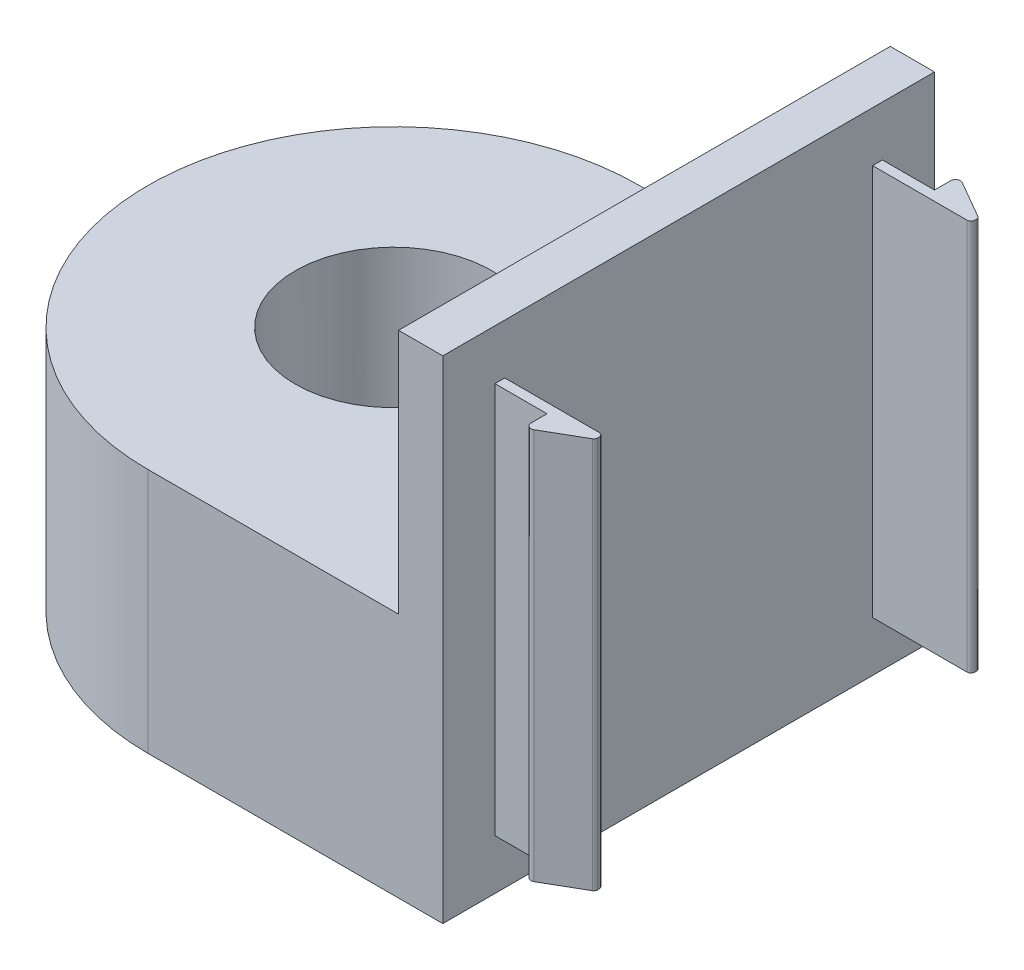
ISO-10303-21;
HEADER;
FILE_DESCRIPTION(('STEP AP214'),'2;1');
FILE_NAME('part.step','',(''),(''),'','','');
FILE_SCHEMA(('AUTOMOTIVE_DESIGN { 1 0 10303 214 1 1 1 1 }'));
ENDSEC;
DATA;
#1=APPLICATION_CONTEXT('core data for automotive mechanical design processes');
#2=APPLICATION_PROTOCOL_DEFINITION('international standard','automotive_design',2000,#1);
#3=PRODUCT_CONTEXT('',#1,'mechanical');
#4=PRODUCT('Part','Part','',(#3));
#5=PRODUCT_RELATED_PRODUCT_CATEGORY('part','',(#4));
#6=PRODUCT_DEFINITION_FORMATION('','',#4);
#7=PRODUCT_DEFINITION_CONTEXT('part definition',#1,'design');
#8=PRODUCT_DEFINITION('design','',#6,#7);
#9=PRODUCT_DEFINITION_SHAPE('','',#8);
#10=(LENGTH_UNIT() NAMED_UNIT(*) SI_UNIT(.MILLI.,.METRE.));
#11=(NAMED_UNIT(*) PLANE_ANGLE_UNIT() SI_UNIT($,.RADIAN.));
#12=(NAMED_UNIT(*) SI_UNIT($,.STERADIAN.) SOLID_ANGLE_UNIT());
#13=UNCERTAINTY_MEASURE_WITH_UNIT(LENGTH_MEASURE(1.E-05),#10,'distance_accuracy_value','');
#14=(GEOMETRIC_REPRESENTATION_CONTEXT(3) GLOBAL_UNCERTAINTY_ASSIGNED_CONTEXT((#13)) GLOBAL_UNIT_ASSIGNED_CONTEXT((#10,
#11,#12)) REPRESENTATION_CONTEXT('',''));
#15=CARTESIAN_POINT('',(0.,0.,0.));
#16=DIRECTION('',(0.,0.,1.));
#17=DIRECTION('',(1.,0.,0.));
#18=AXIS2_PLACEMENT_3D('',#15,#16,#17);
#19=CARTESIAN_POINT('',(-25.,50.,-25.));
#20=DIRECTION('',(0.,1.,0.));
#21=DIRECTION('',(0.,0.,1.));
#22=AXIS2_PLACEMENT_3D('',#19,#20,#21);
#23=PLANE('',#22);
#24=DIRECTION('',(0.,0.,-1.));
#25=VECTOR('',#24,1.);
#26=CARTESIAN_POINT('',(5.,50.,0.));
#27=LINE('',#26,#25);
#28=CARTESIAN_POINT('',(5.,50.,0.));
#29=VERTEX_POINT('',#28);
#30=CARTESIAN_POINT('',(4.99999999999999,50.,-50.));
#31=VERTEX_POINT('',#30);
#32=EDGE_CURVE('E349',#29,#31,#27,.T.);
#33=ORIENTED_EDGE('',*,*,#32,.T.);
#34=DIRECTION('',(-1.,0.,0.));
#35=VECTOR('',#34,1.);
#36=CARTESIAN_POINT('',(0.,50.,-50.));
#37=LINE('',#36,#35);
#38=CARTESIAN_POINT('',(0.5,50.,-50.));
#39=VERTEX_POINT('',#38);
#40=EDGE_CURVE('E352',#31,#39,#37,.T.);
#41=ORIENTED_EDGE('',*,*,#40,.T.);
#42=DIRECTION('',(0.,0.,1.));
#43=VECTOR('',#42,1.);
#44=CARTESIAN_POINT('',(0.500000000000004,50.,0.));
#45=LINE('',#44,#43);
#46=CARTESIAN_POINT('',(0.500000000000004,50.,0.));
#47=VERTEX_POINT('',#46);
#48=EDGE_CURVE('E329',#39,#47,#45,.T.);
#49=ORIENTED_EDGE('',*,*,#48,.T.);
#50=DIRECTION('',(1.,0.,0.));
#51=VECTOR('',#50,1.);
#52=CARTESIAN_POINT('',(0.,50.,0.));
#53=LINE('',#52,#51);
#54=EDGE_CURVE('E347',#47,#29,#53,.T.);
#55=ORIENTED_EDGE('',*,*,#54,.T.);
#56=EDGE_LOOP('',(#33,#41,#49,#55));
#57=FACE_BOUND('',#56,.T.);
#58=ADVANCED_FACE('F41',(#57),#23,.T.);
#59=CARTESIAN_POINT('',(10.3,50.,-5.3));
#60=DIRECTION('',(0.,0.,-1.));
#61=DIRECTION('',(-1.,0.,0.));
#62=AXIS2_PLACEMENT_3D('',#59,#60,#61);
#63=PLANE('',#62);
#64=DIRECTION('',(1.,0.,0.));
#65=VECTOR('',#64,1.);
#66=CARTESIAN_POINT('',(10.3,44.9,-5.3));
#67=LINE('',#66,#65);
#68=CARTESIAN_POINT('',(5.,44.9,-5.3));
#69=VERTEX_POINT('',#68);
#70=CARTESIAN_POINT('',(10.3,44.9,-5.3));
#71=VERTEX_POINT('',#70);
#72=EDGE_CURVE('E226',#69,#71,#67,.T.);
#73=ORIENTED_EDGE('',*,*,#72,.F.);
#74=DIRECTION('',(0.,-1.,0.));
#75=VECTOR('',#74,1.);
#76=CARTESIAN_POINT('',(5.,50.,-5.3));
#77=LINE('',#76,#75);
#78=CARTESIAN_POINT('',(5.,5.1,-5.3));
#79=VERTEX_POINT('',#78);
#80=EDGE_CURVE('E218',#69,#79,#77,.T.);
#81=ORIENTED_EDGE('',*,*,#80,.T.);
#82=DIRECTION('',(1.,0.,0.));
#83=VECTOR('',#82,1.);
#84=CARTESIAN_POINT('',(10.3,5.1,-5.3));
#85=LINE('',#84,#83);
#86=CARTESIAN_POINT('',(10.3,5.1,-5.3));
#87=VERTEX_POINT('',#86);
#88=EDGE_CURVE('E200',#79,#87,#85,.T.);
#89=ORIENTED_EDGE('',*,*,#88,.T.);
#90=DIRECTION('',(0.,-1.,0.));
#91=VECTOR('',#90,1.);
#92=CARTESIAN_POINT('',(10.3,50.,-5.3));
#93=LINE('',#92,#91);
#94=EDGE_CURVE('E228',#71,#87,#93,.T.);
#95=ORIENTED_EDGE('',*,*,#94,.F.);
#96=EDGE_LOOP('',(#73,#81,#89,#95));
#97=FACE_BOUND('',#96,.T.);
#98=ADVANCED_FACE('F225',(#97),#63,.F.);
#99=CARTESIAN_POINT('',(10.3,50.,-2.8));
#100=DIRECTION('',(1.,0.,0.));
#101=DIRECTION('',(0.,0.,-1.));
#102=AXIS2_PLACEMENT_3D('',#99,#100,#101);
#103=PLANE('',#102);
#104=DIRECTION('',(0.,0.,1.));
#105=VECTOR('',#104,1.);
#106=CARTESIAN_POINT('',(10.3,5.1,-2.8));
#107=LINE('',#106,#105);
#108=CARTESIAN_POINT('',(10.3,5.1,-3.66602540378444));
#109=VERTEX_POINT('',#108);
#110=EDGE_CURVE('E206',#87,#109,#107,.T.);
#111=ORIENTED_EDGE('',*,*,#110,.T.);
#112=DIRECTION('',(0.,-1.,0.));
#113=VECTOR('',#112,1.);
#114=CARTESIAN_POINT('',(10.3,50.,-3.66602540378444));
#115=LINE('',#114,#113);
#116=CARTESIAN_POINT('',(10.3,44.9,-3.66602540378444));
#117=VERTEX_POINT('',#116);
#118=EDGE_CURVE('E49',#109,#117,#115,.F.);
#119=ORIENTED_EDGE('',*,*,#118,.T.);
#120=DIRECTION('',(0.,0.,1.));
#121=VECTOR('',#120,1.);
#122=CARTESIAN_POINT('',(10.3,44.9,-2.8));
#123=LINE('',#122,#121);
#124=EDGE_CURVE('E319',#71,#117,#123,.T.);
#125=ORIENTED_EDGE('',*,*,#124,.F.);
#126=ORIENTED_EDGE('',*,*,#94,.T.);
#127=EDGE_LOOP('',(#111,#119,#125,#126));
#128=FACE_BOUND('',#127,.T.);
#129=ADVANCED_FACE('F463',(#128),#103,.F.);
#130=CARTESIAN_POINT('',(15.,50.,-5.51354626519127));
#131=DIRECTION('',(-0.500000000000004,0.,-0.866025403784436));
#132=DIRECTION('',(-0.866025403784436,0.,0.500000000000004));
#133=AXIS2_PLACEMENT_3D('',#130,#131,#132);
#134=PLANE('',#133);
#135=DIRECTION('',(0.866025403784436,0.,-0.500000000000004));
#136=VECTOR('',#135,1.);
#137=CARTESIAN_POINT('',(15.,44.9,-5.51354626519127));
#138=LINE('',#137,#136);
#139=CARTESIAN_POINT('',(11.05,44.9,-3.23301270189223));
#140=VERTEX_POINT('',#139);
#141=CARTESIAN_POINT('',(14.8,44.9,-5.39807621135335));
#142=VERTEX_POINT('',#141);
#143=EDGE_CURVE('E294',#140,#142,#138,.T.);
#144=ORIENTED_EDGE('',*,*,#143,.F.);
#145=DIRECTION('',(0.,-1.,0.));
#146=VECTOR('',#145,1.);
#147=CARTESIAN_POINT('',(11.05,50.,-3.23301270189223));
#148=LINE('',#147,#146);
#149=CARTESIAN_POINT('',(11.05,5.1,-3.23301270189223));
#150=VERTEX_POINT('',#149);
#151=EDGE_CURVE('E286',#140,#150,#148,.T.);
#152=ORIENTED_EDGE('',*,*,#151,.T.);
#153=DIRECTION('',(0.866025403784436,0.,-0.500000000000004));
#154=VECTOR('',#153,1.);
#155=CARTESIAN_POINT('',(15.,5.1,-5.51354626519127));
#156=LINE('',#155,#154);
#157=CARTESIAN_POINT('',(14.8,5.1,-5.39807621135335));
#158=VERTEX_POINT('',#157);
#159=EDGE_CURVE('E293',#150,#158,#156,.T.);
#160=ORIENTED_EDGE('',*,*,#159,.T.);
#161=DIRECTION('',(0.,-1.,0.));
#162=VECTOR('',#161,1.);
#163=CARTESIAN_POINT('',(14.8,50.,-5.39807621135335));
#164=LINE('',#163,#162);
#165=EDGE_CURVE('E274',#158,#142,#164,.F.);
#166=ORIENTED_EDGE('',*,*,#165,.T.);
#167=EDGE_LOOP('',(#144,#152,#160,#166));
#168=FACE_BOUND('',#167,.T.);
#169=ADVANCED_FACE('F292',(#168),#134,.F.);
#170=CARTESIAN_POINT('',(15.,50.,-6.3));
#171=DIRECTION('',(-1.,0.,0.));
#172=DIRECTION('',(0.,0.,1.));
#173=AXIS2_PLACEMENT_3D('',#170,#171,#172);
#174=PLANE('',#173);
#175=DIRECTION('',(0.,0.,-1.));
#176=VECTOR('',#175,1.);
#177=CARTESIAN_POINT('',(15.,5.1,0.));
#178=LINE('',#177,#176);
#179=CARTESIAN_POINT('',(15.,5.1,-5.74448637286712));
#180=VERTEX_POINT('',#179);
#181=CARTESIAN_POINT('',(15.,5.1,-5.9));
#182=VERTEX_POINT('',#181);
#183=EDGE_CURVE('E394',#180,#182,#178,.T.);
#184=ORIENTED_EDGE('',*,*,#183,.T.);
#185=DIRECTION('',(0.,-1.,0.));
#186=VECTOR('',#185,1.);
#187=CARTESIAN_POINT('',(15.,50.,-5.9));
#188=LINE('',#187,#186);
#189=CARTESIAN_POINT('',(15.,44.9,-5.9));
#190=VERTEX_POINT('',#189);
#191=EDGE_CURVE('E268',#182,#190,#188,.F.);
#192=ORIENTED_EDGE('',*,*,#191,.T.);
#193=DIRECTION('',(0.,0.,-1.));
#194=VECTOR('',#193,1.);
#195=CARTESIAN_POINT('',(15.,44.9,0.));
#196=LINE('',#195,#194);
#197=CARTESIAN_POINT('',(15.,44.9,-5.74448637286712));
#198=VERTEX_POINT('',#197);
#199=EDGE_CURVE('E399',#198,#190,#196,.T.);
#200=ORIENTED_EDGE('',*,*,#199,.F.);
#201=DIRECTION('',(0.,-1.,0.));
#202=VECTOR('',#201,1.);
#203=CARTESIAN_POINT('',(15.,50.,-5.74448637286712));
#204=LINE('',#203,#202);
#205=EDGE_CURVE('E265',#198,#180,#204,.T.);
#206=ORIENTED_EDGE('',*,*,#205,.T.);
#207=EDGE_LOOP('',(#184,#192,#200,#206));
#208=FACE_BOUND('',#207,.T.);
#209=ADVANCED_FACE('F498',(#208),#174,.F.);
#210=CARTESIAN_POINT('',(5.,50.,-6.3));
#211=DIRECTION('',(0.,0.,1.));
#212=DIRECTION('',(1.,0.,0.));
#213=AXIS2_PLACEMENT_3D('',#210,#211,#212);
#214=PLANE('',#213);
#215=DIRECTION('',(-1.,0.,0.));
#216=VECTOR('',#215,1.);
#217=CARTESIAN_POINT('',(5.,44.9,-6.3));
#218=LINE('',#217,#216);
#219=CARTESIAN_POINT('',(14.6,44.9,-6.3));
#220=VERTEX_POINT('',#219);
#221=CARTESIAN_POINT('',(5.,44.9,-6.3));
#222=VERTEX_POINT('',#221);
#223=EDGE_CURVE('E316',#220,#222,#218,.T.);
#224=ORIENTED_EDGE('',*,*,#223,.F.);
#225=DIRECTION('',(0.,-1.,0.));
#226=VECTOR('',#225,1.);
#227=CARTESIAN_POINT('',(14.6,50.,-6.3));
#228=LINE('',#227,#226);
#229=CARTESIAN_POINT('',(14.6,5.1,-6.3));
#230=VERTEX_POINT('',#229);
#231=EDGE_CURVE('E257',#220,#230,#228,.T.);
#232=ORIENTED_EDGE('',*,*,#231,.T.);
#233=DIRECTION('',(-1.,0.,0.));
#234=VECTOR('',#233,1.);
#235=CARTESIAN_POINT('',(5.,5.1,-6.3));
#236=LINE('',#235,#234);
#237=CARTESIAN_POINT('',(5.,5.1,-6.3));
#238=VERTEX_POINT('',#237);
#239=EDGE_CURVE('E299',#230,#238,#236,.T.);
#240=ORIENTED_EDGE('',*,*,#239,.T.);
#241=DIRECTION('',(0.,-1.,0.));
#242=VECTOR('',#241,1.);
#243=CARTESIAN_POINT('',(5.,50.,-6.3));
#244=LINE('',#243,#242);
#245=EDGE_CURVE('E220',#222,#238,#244,.T.);
#246=ORIENTED_EDGE('',*,*,#245,.F.);
#247=EDGE_LOOP('',(#224,#232,#240,#246));
#248=FACE_BOUND('',#247,.T.);
#249=ADVANCED_FACE('F495',(#248),#214,.F.);
#250=CARTESIAN_POINT('',(15.,50.,-43.7));
#251=DIRECTION('',(0.,0.,-1.));
#252=DIRECTION('',(-1.,0.,0.));
#253=AXIS2_PLACEMENT_3D('',#250,#251,#252);
#254=PLANE('',#253);
#255=DIRECTION('',(1.,0.,0.));
#256=VECTOR('',#255,1.);
#257=CARTESIAN_POINT('',(15.,5.1,-43.7));
#258=LINE('',#257,#256);
#259=CARTESIAN_POINT('',(4.99999999999999,5.1,-43.7));
#260=VERTEX_POINT('',#259);
#261=CARTESIAN_POINT('',(14.6,5.1,-43.7));
#262=VERTEX_POINT('',#261);
#263=EDGE_CURVE('E302',#260,#262,#258,.T.);
#264=ORIENTED_EDGE('',*,*,#263,.T.);
#265=DIRECTION('',(0.,-1.,0.));
#266=VECTOR('',#265,1.);
#267=CARTESIAN_POINT('',(14.6,50.,-43.7));
#268=LINE('',#267,#266);
#269=CARTESIAN_POINT('',(14.6,44.9,-43.7));
#270=VERTEX_POINT('',#269);
#271=EDGE_CURVE('E248',#262,#270,#268,.F.);
#272=ORIENTED_EDGE('',*,*,#271,.T.);
#273=DIRECTION('',(1.,0.,0.));
#274=VECTOR('',#273,1.);
#275=CARTESIAN_POINT('',(15.,44.9,-43.7));
#276=LINE('',#275,#274);
#277=CARTESIAN_POINT('',(4.99999999999999,44.9,-43.7));
#278=VERTEX_POINT('',#277);
#279=EDGE_CURVE('E313',#278,#270,#276,.T.);
#280=ORIENTED_EDGE('',*,*,#279,.F.);
#281=DIRECTION('',(0.,-1.,0.));
#282=VECTOR('',#281,1.);
#283=CARTESIAN_POINT('',(5.,50.,-43.7));
#284=LINE('',#283,#282);
#285=EDGE_CURVE('E377',#278,#260,#284,.T.);
#286=ORIENTED_EDGE('',*,*,#285,.T.);
#287=EDGE_LOOP('',(#264,#272,#280,#286));
#288=FACE_BOUND('',#287,.T.);
#289=ADVANCED_FACE('F383',(#288),#254,.F.);
#290=CARTESIAN_POINT('',(15.,50.,-44.4864537348087));
#291=DIRECTION('',(-1.,0.,0.));
#292=DIRECTION('',(0.,0.,1.));
#293=AXIS2_PLACEMENT_3D('',#290,#291,#292);
#294=PLANE('',#293);
#295=CARTESIAN_POINT('',(15.,44.9,-44.1));
#296=VERTEX_POINT('',#295);
#297=CARTESIAN_POINT('',(15.,44.9,-44.2555136271329));
#298=VERTEX_POINT('',#297);
#299=EDGE_CURVE('E425',#296,#298,#196,.T.);
#300=ORIENTED_EDGE('',*,*,#299,.F.);
#301=DIRECTION('',(0.,-1.,0.));
#302=VECTOR('',#301,1.);
#303=CARTESIAN_POINT('',(15.,50.,-44.1));
#304=LINE('',#303,#302);
#305=CARTESIAN_POINT('',(15.,5.1,-44.1));
#306=VERTEX_POINT('',#305);
#307=EDGE_CURVE('E241',#296,#306,#304,.T.);
#308=ORIENTED_EDGE('',*,*,#307,.T.);
#309=CARTESIAN_POINT('',(15.,5.1,-44.2555136271329));
#310=VERTEX_POINT('',#309);
#311=EDGE_CURVE('E221',#306,#310,#178,.T.);
#312=ORIENTED_EDGE('',*,*,#311,.T.);
#313=DIRECTION('',(0.,-1.,0.));
#314=VECTOR('',#313,1.);
#315=CARTESIAN_POINT('',(15.,50.,-44.2555136271329));
#316=LINE('',#315,#314);
#317=EDGE_CURVE('E230',#310,#298,#316,.F.);
#318=ORIENTED_EDGE('',*,*,#317,.T.);
#319=EDGE_LOOP('',(#300,#308,#312,#318));
#320=FACE_BOUND('',#319,.T.);
#321=ADVANCED_FACE('F443',(#320),#294,.F.);
#322=CARTESIAN_POINT('',(10.3,50.,-47.2));
#323=DIRECTION('',(-0.500000000000004,0.,0.866025403784436));
#324=DIRECTION('',(0.866025403784436,0.,0.500000000000004));
#325=AXIS2_PLACEMENT_3D('',#322,#323,#324);
#326=PLANE('',#325);
#327=DIRECTION('',(-0.866025403784436,0.,-0.500000000000004));
#328=VECTOR('',#327,1.);
#329=CARTESIAN_POINT('',(10.3,5.1,-47.2));
#330=LINE('',#329,#328);
#331=CARTESIAN_POINT('',(14.8,5.1,-44.6019237886467));
#332=VERTEX_POINT('',#331);
#333=CARTESIAN_POINT('',(11.05,5.1,-46.7669872981078));
#334=VERTEX_POINT('',#333);
#335=EDGE_CURVE('E401',#332,#334,#330,.T.);
#336=ORIENTED_EDGE('',*,*,#335,.T.);
#337=DIRECTION('',(0.,-1.,0.));
#338=VECTOR('',#337,1.);
#339=CARTESIAN_POINT('',(11.05,50.,-46.7669872981078));
#340=LINE('',#339,#338);
#341=CARTESIAN_POINT('',(11.05,44.9,-46.7669872981078));
#342=VERTEX_POINT('',#341);
#343=EDGE_CURVE('E282',#334,#342,#340,.F.);
#344=ORIENTED_EDGE('',*,*,#343,.T.);
#345=DIRECTION('',(-0.866025403784436,0.,-0.500000000000004));
#346=VECTOR('',#345,1.);
#347=CARTESIAN_POINT('',(10.3,44.9,-47.2));
#348=LINE('',#347,#346);
#349=CARTESIAN_POINT('',(14.8,44.9,-44.6019237886467));
#350=VERTEX_POINT('',#349);
#351=EDGE_CURVE('E310',#350,#342,#348,.T.);
#352=ORIENTED_EDGE('',*,*,#351,.F.);
#353=DIRECTION('',(0.,-1.,0.));
#354=VECTOR('',#353,1.);
#355=CARTESIAN_POINT('',(14.8,50.,-44.6019237886467));
#356=LINE('',#355,#354);
#357=EDGE_CURVE('E254',#350,#332,#356,.T.);
#358=ORIENTED_EDGE('',*,*,#357,.T.);
#359=EDGE_LOOP('',(#336,#344,#352,#358));
#360=FACE_BOUND('',#359,.T.);
#361=ADVANCED_FACE('F406',(#360),#326,.F.);
#362=CARTESIAN_POINT('',(10.3,50.,-44.7));
#363=DIRECTION('',(1.,0.,0.));
#364=DIRECTION('',(0.,0.,-1.));
#365=AXIS2_PLACEMENT_3D('',#362,#363,#364);
#366=PLANE('',#365);
#367=DIRECTION('',(0.,0.,1.));
#368=VECTOR('',#367,1.);
#369=CARTESIAN_POINT('',(10.3,44.9,-44.7));
#370=LINE('',#369,#368);
#371=CARTESIAN_POINT('',(10.3,44.9,-46.3339745962156));
#372=VERTEX_POINT('',#371);
#373=CARTESIAN_POINT('',(10.3,44.9,-44.7));
#374=VERTEX_POINT('',#373);
#375=EDGE_CURVE('E308',#372,#374,#370,.T.);
#376=ORIENTED_EDGE('',*,*,#375,.F.);
#377=DIRECTION('',(0.,-1.,0.));
#378=VECTOR('',#377,1.);
#379=CARTESIAN_POINT('',(10.3,50.,-46.3339745962156));
#380=LINE('',#379,#378);
#381=CARTESIAN_POINT('',(10.3,5.1,-46.3339745962156));
#382=VERTEX_POINT('',#381);
#383=EDGE_CURVE('E277',#372,#382,#380,.T.);
#384=ORIENTED_EDGE('',*,*,#383,.T.);
#385=DIRECTION('',(0.,0.,1.));
#386=VECTOR('',#385,1.);
#387=CARTESIAN_POINT('',(10.3,5.1,-44.7));
#388=LINE('',#387,#386);
#389=CARTESIAN_POINT('',(10.3,5.1,-44.7));
#390=VERTEX_POINT('',#389);
#391=EDGE_CURVE('E398',#382,#390,#388,.T.);
#392=ORIENTED_EDGE('',*,*,#391,.T.);
#393=DIRECTION('',(0.,-1.,0.));
#394=VECTOR('',#393,1.);
#395=CARTESIAN_POINT('',(10.3,50.,-44.7));
#396=LINE('',#395,#394);
#397=EDGE_CURVE('E374',#374,#390,#396,.T.);
#398=ORIENTED_EDGE('',*,*,#397,.F.);
#399=EDGE_LOOP('',(#376,#384,#392,#398));
#400=FACE_BOUND('',#399,.T.);
#401=ADVANCED_FACE('F419',(#400),#366,.F.);
#402=CARTESIAN_POINT('',(5.,50.,-44.7));
#403=DIRECTION('',(0.,0.,1.));
#404=DIRECTION('',(1.,0.,0.));
#405=AXIS2_PLACEMENT_3D('',#402,#403,#404);
#406=PLANE('',#405);
#407=DIRECTION('',(-1.,0.,0.));
#408=VECTOR('',#407,1.);
#409=CARTESIAN_POINT('',(5.,44.9,-44.7));
#410=LINE('',#409,#408);
#411=CARTESIAN_POINT('',(5.,44.9,-44.7));
#412=VERTEX_POINT('',#411);
#413=EDGE_CURVE('E211',#374,#412,#410,.T.);
#414=ORIENTED_EDGE('',*,*,#413,.F.);
#415=ORIENTED_EDGE('',*,*,#397,.T.);
#416=DIRECTION('',(-1.,0.,0.));
#417=VECTOR('',#416,1.);
#418=CARTESIAN_POINT('',(5.,5.1,-44.7));
#419=LINE('',#418,#417);
#420=CARTESIAN_POINT('',(4.99999999999999,5.1,-44.7));
#421=VERTEX_POINT('',#420);
#422=EDGE_CURVE('E396',#390,#421,#419,.T.);
#423=ORIENTED_EDGE('',*,*,#422,.T.);
#424=DIRECTION('',(0.,-1.,0.));
#425=VECTOR('',#424,1.);
#426=CARTESIAN_POINT('',(5.,50.,-44.7));
#427=LINE('',#426,#425);
#428=EDGE_CURVE('E371',#412,#421,#427,.T.);
#429=ORIENTED_EDGE('',*,*,#428,.F.);
#430=EDGE_LOOP('',(#414,#415,#423,#429));
#431=FACE_BOUND('',#430,.T.);
#432=ADVANCED_FACE('F422',(#431),#406,.F.);
#433=CARTESIAN_POINT('',(-25.,0.,-25.));
#434=DIRECTION('',(0.,1.,0.));
#435=DIRECTION('',(0.,0.,1.));
#436=AXIS2_PLACEMENT_3D('',#433,#434,#435);
#437=PLANE('',#436);
#438=CARTESIAN_POINT('',(-25.,0.,-25.));
#439=DIRECTION('',(0.,-1.,0.));
#440=DIRECTION('',(0.,0.,-1.));
#441=AXIS2_PLACEMENT_3D('',#438,#439,#440);
#442=CIRCLE('',#441,15.);
#443=CARTESIAN_POINT('',(-25.,0.,-40.));
#444=VERTEX_POINT('',#443);
#445=EDGE_CURVE('E322',#444,#444,#442,.T.);
#446=ORIENTED_EDGE('',*,*,#445,.F.);
#447=EDGE_LOOP('',(#446));
#448=FACE_BOUND('',#447,.T.);
#449=DIRECTION('',(0.,0.,-1.));
#450=VECTOR('',#449,1.);
#451=CARTESIAN_POINT('',(5.,0.,-44.7));
#452=LINE('',#451,#450);
#453=CARTESIAN_POINT('',(5.,0.,0.));
#454=VERTEX_POINT('',#453);
#455=CARTESIAN_POINT('',(4.99999999999999,0.,-50.));
#456=VERTEX_POINT('',#455);
#457=EDGE_CURVE('E358',#454,#456,#452,.T.);
#458=ORIENTED_EDGE('',*,*,#457,.F.);
#459=DIRECTION('',(1.,0.,0.));
#460=VECTOR('',#459,1.);
#461=CARTESIAN_POINT('',(0.,0.,0.));
#462=LINE('',#461,#460);
#463=CARTESIAN_POINT('',(-25.,0.,0.));
#464=VERTEX_POINT('',#463);
#465=EDGE_CURVE('E344',#464,#454,#462,.T.);
#466=ORIENTED_EDGE('',*,*,#465,.F.);
#467=CARTESIAN_POINT('',(-25.,0.,-25.));
#468=DIRECTION('',(0.,1.,0.));
#469=DIRECTION('',(0.,0.,1.));
#470=AXIS2_PLACEMENT_3D('',#467,#468,#469);
#471=CIRCLE('',#470,25.);
#472=CARTESIAN_POINT('',(-25.,0.,-50.));
#473=VERTEX_POINT('',#472);
#474=EDGE_CURVE('E350',#473,#464,#471,.T.);
#475=ORIENTED_EDGE('',*,*,#474,.F.);
#476=DIRECTION('',(-1.,0.,0.));
#477=VECTOR('',#476,1.);
#478=CARTESIAN_POINT('',(0.,0.,-50.));
#479=LINE('',#478,#477);
#480=EDGE_CURVE('E361',#456,#473,#479,.T.);
#481=ORIENTED_EDGE('',*,*,#480,.F.);
#482=EDGE_LOOP('',(#458,#466,#475,#481));
#483=FACE_BOUND('',#482,.T.);
#484=ADVANCED_FACE('F469',(#448,#483),#437,.F.);
#485=CARTESIAN_POINT('',(-25.,0.,-25.));
#486=DIRECTION('',(0.,1.,0.));
#487=DIRECTION('',(0.,0.,1.));
#488=AXIS2_PLACEMENT_3D('',#485,#486,#487);
#489=CYLINDRICAL_SURFACE('',#488,10.);
#490=CARTESIAN_POINT('',(-25.,25.,-25.));
#491=DIRECTION('',(0.,1.,0.));
#492=DIRECTION('',(0.,0.,1.));
#493=AXIS2_PLACEMENT_3D('',#490,#491,#492);
#494=CIRCLE('',#493,10.);
#495=CARTESIAN_POINT('',(-25.,25.,-15.));
#496=VERTEX_POINT('',#495);
#497=EDGE_CURVE('E238',#496,#496,#494,.T.);
#498=ORIENTED_EDGE('',*,*,#497,.T.);
#499=EDGE_LOOP('',(#498));
#500=FACE_BOUND('',#499,.T.);
#501=CARTESIAN_POINT('',(-25.,5.,-25.));
#502=DIRECTION('',(0.,-1.,0.));
#503=DIRECTION('',(0.,0.,-1.));
#504=AXIS2_PLACEMENT_3D('',#501,#502,#503);
#505=CIRCLE('',#504,10.);
#506=CARTESIAN_POINT('',(-25.,5.,-35.));
#507=VERTEX_POINT('',#506);
#508=EDGE_CURVE('E235',#507,#507,#505,.F.);
#509=ORIENTED_EDGE('',*,*,#508,.F.);
#510=EDGE_LOOP('',(#509));
#511=FACE_BOUND('',#510,.T.);
#512=ADVANCED_FACE('F472',(#500,#511),#489,.F.);
#513=CARTESIAN_POINT('',(0.,50.,0.));
#514=DIRECTION('',(0.,0.,-1.));
#515=DIRECTION('',(-1.,0.,0.));
#516=AXIS2_PLACEMENT_3D('',#513,#514,#515);
#517=PLANE('',#516);
#518=DIRECTION('',(0.,1.,0.));
#519=VECTOR('',#518,1.);
#520=CARTESIAN_POINT('',(0.500000000000004,25.,0.));
#521=LINE('',#520,#519);
#522=CARTESIAN_POINT('',(0.500000000000004,25.,0.));
#523=VERTEX_POINT('',#522);
#524=EDGE_CURVE('E342',#523,#47,#521,.T.);
#525=ORIENTED_EDGE('',*,*,#524,.F.);
#526=DIRECTION('',(1.,0.,0.));
#527=VECTOR('',#526,1.);
#528=CARTESIAN_POINT('',(0.,25.,0.));
#529=LINE('',#528,#527);
#530=CARTESIAN_POINT('',(-25.,25.,0.));
#531=VERTEX_POINT('',#530);
#532=EDGE_CURVE('E336',#531,#523,#529,.T.);
#533=ORIENTED_EDGE('',*,*,#532,.F.);
#534=DIRECTION('',(0.,-1.,0.));
#535=VECTOR('',#534,1.);
#536=CARTESIAN_POINT('',(-25.,50.,0.));
#537=LINE('',#536,#535);
#538=EDGE_CURVE('E355',#531,#464,#537,.T.);
#539=ORIENTED_EDGE('',*,*,#538,.T.);
#540=ORIENTED_EDGE('',*,*,#465,.T.);
#541=DIRECTION('',(0.,-1.,0.));
#542=VECTOR('',#541,1.);
#543=CARTESIAN_POINT('',(5.,50.,0.));
#544=LINE('',#543,#542);
#545=EDGE_CURVE('E227',#29,#454,#544,.T.);
#546=ORIENTED_EDGE('',*,*,#545,.F.);
#547=ORIENTED_EDGE('',*,*,#54,.F.);
#548=EDGE_LOOP('',(#525,#533,#539,#540,#546,#547));
#549=FACE_BOUND('',#548,.T.);
#550=ADVANCED_FACE('F481',(#549),#517,.F.);
#551=CARTESIAN_POINT('',(0.,50.,-50.));
#552=DIRECTION('',(0.,0.,1.));
#553=DIRECTION('',(1.,0.,0.));
#554=AXIS2_PLACEMENT_3D('',#551,#552,#553);
#555=PLANE('',#554);
#556=DIRECTION('',(0.,1.,0.));
#557=VECTOR('',#556,1.);
#558=CARTESIAN_POINT('',(0.5,25.,-50.));
#559=LINE('',#558,#557);
#560=CARTESIAN_POINT('',(0.5,25.,-50.));
#561=VERTEX_POINT('',#560);
#562=EDGE_CURVE('E339',#561,#39,#559,.T.);
#563=ORIENTED_EDGE('',*,*,#562,.T.);
#564=ORIENTED_EDGE('',*,*,#40,.F.);
#565=DIRECTION('',(0.,-1.,0.));
#566=VECTOR('',#565,1.);
#567=CARTESIAN_POINT('',(4.99999999999999,50.,-50.));
#568=LINE('',#567,#566);
#569=EDGE_CURVE('E369',#31,#456,#568,.T.);
#570=ORIENTED_EDGE('',*,*,#569,.T.);
#571=ORIENTED_EDGE('',*,*,#480,.T.);
#572=DIRECTION('',(0.,-1.,0.));
#573=VECTOR('',#572,1.);
#574=CARTESIAN_POINT('',(-25.,50.,-50.));
#575=LINE('',#574,#573);
#576=CARTESIAN_POINT('',(-25.,25.,-50.));
#577=VERTEX_POINT('',#576);
#578=EDGE_CURVE('E367',#577,#473,#575,.T.);
#579=ORIENTED_EDGE('',*,*,#578,.F.);
#580=DIRECTION('',(-1.,0.,0.));
#581=VECTOR('',#580,1.);
#582=CARTESIAN_POINT('',(-1.38777878078145E-13,25.,-50.));
#583=LINE('',#582,#581);
#584=EDGE_CURVE('E332',#561,#577,#583,.T.);
#585=ORIENTED_EDGE('',*,*,#584,.F.);
#586=EDGE_LOOP('',(#563,#564,#570,#571,#579,#585));
#587=FACE_BOUND('',#586,.T.);
#588=ADVANCED_FACE('F477',(#587),#555,.F.);
#589=CARTESIAN_POINT('',(-25.,50.,-25.));
#590=DIRECTION('',(0.,-1.,0.));
#591=DIRECTION('',(0.,0.,-1.));
#592=AXIS2_PLACEMENT_3D('',#589,#590,#591);
#593=CYLINDRICAL_SURFACE('',#592,25.);
#594=CARTESIAN_POINT('',(-25.,25.,-25.));
#595=DIRECTION('',(0.,1.,0.));
#596=DIRECTION('',(0.,0.,1.));
#597=AXIS2_PLACEMENT_3D('',#594,#595,#596);
#598=CIRCLE('',#597,25.);
#599=EDGE_CURVE('E334',#577,#531,#598,.T.);
#600=ORIENTED_EDGE('',*,*,#599,.F.);
#601=ORIENTED_EDGE('',*,*,#578,.T.);
#602=ORIENTED_EDGE('',*,*,#474,.T.);
#603=ORIENTED_EDGE('',*,*,#538,.F.);
#604=EDGE_LOOP('',(#600,#601,#602,#603));
#605=FACE_BOUND('',#604,.T.);
#606=ADVANCED_FACE('F474',(#605),#593,.T.);
#607=CARTESIAN_POINT('',(5.,50.,-44.7));
#608=DIRECTION('',(-1.,0.,0.));
#609=DIRECTION('',(0.,0.,1.));
#610=AXIS2_PLACEMENT_3D('',#607,#608,#609);
#611=PLANE('',#610);
#612=ORIENTED_EDGE('',*,*,#80,.F.);
#613=DIRECTION('',(0.,0.,-1.));
#614=VECTOR('',#613,1.);
#615=CARTESIAN_POINT('',(5.,44.9,0.));
#616=LINE('',#615,#614);
#617=EDGE_CURVE('E424',#69,#222,#616,.T.);
#618=ORIENTED_EDGE('',*,*,#617,.T.);
#619=ORIENTED_EDGE('',*,*,#245,.T.);
#620=DIRECTION('',(0.,0.,-1.));
#621=VECTOR('',#620,1.);
#622=CARTESIAN_POINT('',(5.,5.1,0.));
#623=LINE('',#622,#621);
#624=EDGE_CURVE('E204',#79,#238,#623,.T.);
#625=ORIENTED_EDGE('',*,*,#624,.F.);
#626=EDGE_LOOP('',(#612,#618,#619,#625));
#627=FACE_BOUND('',#626,.T.);
#628=ORIENTED_EDGE('',*,*,#285,.F.);
#629=EDGE_CURVE('E387',#278,#412,#616,.T.);
#630=ORIENTED_EDGE('',*,*,#629,.T.);
#631=ORIENTED_EDGE('',*,*,#428,.T.);
#632=EDGE_CURVE('E222',#260,#421,#623,.T.);
#633=ORIENTED_EDGE('',*,*,#632,.F.);
#634=EDGE_LOOP('',(#628,#630,#631,#633));
#635=FACE_BOUND('',#634,.T.);
#636=ORIENTED_EDGE('',*,*,#569,.F.);
#637=ORIENTED_EDGE('',*,*,#32,.F.);
#638=ORIENTED_EDGE('',*,*,#545,.T.);
#639=ORIENTED_EDGE('',*,*,#457,.T.);
#640=EDGE_LOOP('',(#636,#637,#638,#639));
#641=FACE_BOUND('',#640,.T.);
#642=ADVANCED_FACE('F215',(#627,#635,#641),#611,.F.);
#643=CARTESIAN_POINT('',(0.500000000000004,25.,0.));
#644=DIRECTION('',(-1.,0.,0.));
#645=DIRECTION('',(0.,0.,1.));
#646=AXIS2_PLACEMENT_3D('',#643,#644,#645);
#647=PLANE('',#646);
#648=ORIENTED_EDGE('',*,*,#48,.F.);
#649=ORIENTED_EDGE('',*,*,#562,.F.);
#650=DIRECTION('',(0.,0.,1.));
#651=VECTOR('',#650,1.);
#652=CARTESIAN_POINT('',(0.500000000000004,25.,0.));
#653=LINE('',#652,#651);
#654=EDGE_CURVE('E330',#561,#523,#653,.T.);
#655=ORIENTED_EDGE('',*,*,#654,.T.);
#656=ORIENTED_EDGE('',*,*,#524,.T.);
#657=EDGE_LOOP('',(#648,#649,#655,#656));
#658=FACE_BOUND('',#657,.T.);
#659=ADVANCED_FACE('F467',(#658),#647,.T.);
#660=CARTESIAN_POINT('',(0.,25.,0.));
#661=DIRECTION('',(0.,1.,0.));
#662=DIRECTION('',(0.,0.,1.));
#663=AXIS2_PLACEMENT_3D('',#660,#661,#662);
#664=PLANE('',#663);
#665=ORIENTED_EDGE('',*,*,#497,.F.);
#666=EDGE_LOOP('',(#665));
#667=FACE_BOUND('',#666,.T.);
#668=ORIENTED_EDGE('',*,*,#654,.F.);
#669=ORIENTED_EDGE('',*,*,#584,.T.);
#670=ORIENTED_EDGE('',*,*,#599,.T.);
#671=ORIENTED_EDGE('',*,*,#532,.T.);
#672=EDGE_LOOP('',(#668,#669,#670,#671));
#673=FACE_BOUND('',#672,.T.);
#674=ADVANCED_FACE('F527',(#667,#673),#664,.T.);
#675=CARTESIAN_POINT('',(-25.,5.,-25.));
#676=DIRECTION('',(0.,-1.,0.));
#677=DIRECTION('',(0.,0.,-1.));
#678=AXIS2_PLACEMENT_3D('',#675,#676,#677);
#679=PLANE('',#678);
#680=CARTESIAN_POINT('',(-25.,5.,-25.));
#681=DIRECTION('',(0.,-1.,0.));
#682=DIRECTION('',(0.,0.,-1.));
#683=AXIS2_PLACEMENT_3D('',#680,#681,#682);
#684=CIRCLE('',#683,15.);
#685=CARTESIAN_POINT('',(-25.,5.,-40.));
#686=VERTEX_POINT('',#685);
#687=EDGE_CURVE('E239',#686,#686,#684,.T.);
#688=ORIENTED_EDGE('',*,*,#687,.T.);
#689=EDGE_LOOP('',(#688));
#690=FACE_BOUND('',#689,.T.);
#691=ORIENTED_EDGE('',*,*,#508,.T.);
#692=EDGE_LOOP('',(#691));
#693=FACE_BOUND('',#692,.T.);
#694=ADVANCED_FACE('F534',(#690,#693),#679,.T.);
#695=CARTESIAN_POINT('',(-25.,5.,-25.));
#696=DIRECTION('',(0.,-1.,0.));
#697=DIRECTION('',(0.,0.,-1.));
#698=AXIS2_PLACEMENT_3D('',#695,#696,#697);
#699=CYLINDRICAL_SURFACE('',#698,15.);
#700=ORIENTED_EDGE('',*,*,#687,.F.);
#701=EDGE_LOOP('',(#700));
#702=FACE_BOUND('',#701,.T.);
#703=ORIENTED_EDGE('',*,*,#445,.T.);
#704=EDGE_LOOP('',(#703));
#705=FACE_BOUND('',#704,.T.);
#706=ADVANCED_FACE('F540',(#702,#705),#699,.F.);
#707=CARTESIAN_POINT('',(15.,5.1,0.));
#708=DIRECTION('',(0.,1.,0.));
#709=DIRECTION('',(0.,0.,1.));
#710=AXIS2_PLACEMENT_3D('',#707,#708,#709);
#711=PLANE('',#710);
#712=ORIENTED_EDGE('',*,*,#391,.F.);
#713=CARTESIAN_POINT('',(10.8,5.1,-46.3339745962156));
#714=DIRECTION('',(0.,1.,0.));
#715=DIRECTION('',(0.,0.,1.));
#716=AXIS2_PLACEMENT_3D('',#713,#714,#715);
#717=CIRCLE('',#716,0.5);
#718=EDGE_CURVE('E280',#382,#334,#717,.F.);
#719=ORIENTED_EDGE('',*,*,#718,.T.);
#720=ORIENTED_EDGE('',*,*,#335,.F.);
#721=CARTESIAN_POINT('',(14.6,5.1,-44.2555136271329));
#722=DIRECTION('',(0.,1.,0.));
#723=DIRECTION('',(0.,0.,1.));
#724=AXIS2_PLACEMENT_3D('',#721,#722,#723);
#725=CIRCLE('',#724,0.4);
#726=EDGE_CURVE('E244',#332,#310,#725,.F.);
#727=ORIENTED_EDGE('',*,*,#726,.T.);
#728=ORIENTED_EDGE('',*,*,#311,.F.);
#729=CARTESIAN_POINT('',(14.6,5.1,-44.1));
#730=DIRECTION('',(0.,1.,0.));
#731=DIRECTION('',(0.,0.,1.));
#732=AXIS2_PLACEMENT_3D('',#729,#730,#731);
#733=CIRCLE('',#732,0.4);
#734=EDGE_CURVE('E246',#306,#262,#733,.F.);
#735=ORIENTED_EDGE('',*,*,#734,.T.);
#736=ORIENTED_EDGE('',*,*,#263,.F.);
#737=ORIENTED_EDGE('',*,*,#632,.T.);
#738=ORIENTED_EDGE('',*,*,#422,.F.);
#739=EDGE_LOOP('',(#712,#719,#720,#727,#728,#735,#736,#737,#738));
#740=FACE_BOUND('',#739,.T.);
#741=ADVANCED_FACE('F442',(#740),#711,.F.);
#742=ORIENTED_EDGE('',*,*,#159,.F.);
#743=CARTESIAN_POINT('',(10.8,5.1,-3.66602540378444));
#744=DIRECTION('',(0.,1.,0.));
#745=DIRECTION('',(0.,0.,1.));
#746=AXIS2_PLACEMENT_3D('',#743,#744,#745);
#747=CIRCLE('',#746,0.5);
#748=EDGE_CURVE('E63',#150,#109,#747,.F.);
#749=ORIENTED_EDGE('',*,*,#748,.T.);
#750=ORIENTED_EDGE('',*,*,#110,.F.);
#751=ORIENTED_EDGE('',*,*,#88,.F.);
#752=ORIENTED_EDGE('',*,*,#624,.T.);
#753=ORIENTED_EDGE('',*,*,#239,.F.);
#754=CARTESIAN_POINT('',(14.6,5.1,-5.9));
#755=DIRECTION('',(0.,1.,0.));
#756=DIRECTION('',(0.,0.,1.));
#757=AXIS2_PLACEMENT_3D('',#754,#755,#756);
#758=CIRCLE('',#757,0.4);
#759=EDGE_CURVE('E263',#230,#182,#758,.F.);
#760=ORIENTED_EDGE('',*,*,#759,.T.);
#761=ORIENTED_EDGE('',*,*,#183,.F.);
#762=CARTESIAN_POINT('',(14.6,5.1,-5.74448637286712));
#763=DIRECTION('',(0.,1.,0.));
#764=DIRECTION('',(0.,0.,1.));
#765=AXIS2_PLACEMENT_3D('',#762,#763,#764);
#766=CIRCLE('',#765,0.4);
#767=EDGE_CURVE('E260',#180,#158,#766,.F.);
#768=ORIENTED_EDGE('',*,*,#767,.T.);
#769=EDGE_LOOP('',(#742,#749,#750,#751,#752,#753,#760,#761,#768));
#770=FACE_BOUND('',#769,.T.);
#771=ADVANCED_FACE('F202',(#770),#711,.F.);
#772=CARTESIAN_POINT('',(15.,44.9,0.));
#773=DIRECTION('',(0.,1.,0.));
#774=DIRECTION('',(0.,0.,1.));
#775=AXIS2_PLACEMENT_3D('',#772,#773,#774);
#776=PLANE('',#775);
#777=ORIENTED_EDGE('',*,*,#351,.T.);
#778=CARTESIAN_POINT('',(10.8,44.9,-46.3339745962156));
#779=DIRECTION('',(0.,1.,0.));
#780=DIRECTION('',(0.,0.,1.));
#781=AXIS2_PLACEMENT_3D('',#778,#779,#780);
#782=CIRCLE('',#781,0.5);
#783=EDGE_CURVE('E284',#342,#372,#782,.T.);
#784=ORIENTED_EDGE('',*,*,#783,.T.);
#785=ORIENTED_EDGE('',*,*,#375,.T.);
#786=ORIENTED_EDGE('',*,*,#413,.T.);
#787=ORIENTED_EDGE('',*,*,#629,.F.);
#788=ORIENTED_EDGE('',*,*,#279,.T.);
#789=CARTESIAN_POINT('',(14.6,44.9,-44.1));
#790=DIRECTION('',(0.,1.,0.));
#791=DIRECTION('',(0.,0.,1.));
#792=AXIS2_PLACEMENT_3D('',#789,#790,#791);
#793=CIRCLE('',#792,0.4);
#794=EDGE_CURVE('E252',#270,#296,#793,.T.);
#795=ORIENTED_EDGE('',*,*,#794,.T.);
#796=ORIENTED_EDGE('',*,*,#299,.T.);
#797=CARTESIAN_POINT('',(14.6,44.9,-44.2555136271329));
#798=DIRECTION('',(0.,1.,0.));
#799=DIRECTION('',(0.,0.,1.));
#800=AXIS2_PLACEMENT_3D('',#797,#798,#799);
#801=CIRCLE('',#800,0.4);
#802=EDGE_CURVE('E250',#298,#350,#801,.T.);
#803=ORIENTED_EDGE('',*,*,#802,.T.);
#804=EDGE_LOOP('',(#777,#784,#785,#786,#787,#788,#795,#796,#803));
#805=FACE_BOUND('',#804,.T.);
#806=ADVANCED_FACE('F415',(#805),#776,.T.);
#807=ORIENTED_EDGE('',*,*,#124,.T.);
#808=CARTESIAN_POINT('',(10.8,44.9,-3.66602540378444));
#809=DIRECTION('',(0.,1.,0.));
#810=DIRECTION('',(0.,0.,1.));
#811=AXIS2_PLACEMENT_3D('',#808,#809,#810);
#812=CIRCLE('',#811,0.5);
#813=EDGE_CURVE('E11',#117,#140,#812,.T.);
#814=ORIENTED_EDGE('',*,*,#813,.T.);
#815=ORIENTED_EDGE('',*,*,#143,.T.);
#816=CARTESIAN_POINT('',(14.6,44.9,-5.74448637286712));
#817=DIRECTION('',(0.,1.,0.));
#818=DIRECTION('',(0.,0.,1.));
#819=AXIS2_PLACEMENT_3D('',#816,#817,#818);
#820=CIRCLE('',#819,0.4);
#821=EDGE_CURVE('E270',#142,#198,#820,.T.);
#822=ORIENTED_EDGE('',*,*,#821,.T.);
#823=ORIENTED_EDGE('',*,*,#199,.T.);
#824=CARTESIAN_POINT('',(14.6,44.9,-5.9));
#825=DIRECTION('',(0.,1.,0.));
#826=DIRECTION('',(0.,0.,1.));
#827=AXIS2_PLACEMENT_3D('',#824,#825,#826);
#828=CIRCLE('',#827,0.4);
#829=EDGE_CURVE('E272',#190,#220,#828,.T.);
#830=ORIENTED_EDGE('',*,*,#829,.T.);
#831=ORIENTED_EDGE('',*,*,#223,.T.);
#832=ORIENTED_EDGE('',*,*,#617,.F.);
#833=ORIENTED_EDGE('',*,*,#72,.T.);
#834=EDGE_LOOP('',(#807,#814,#815,#822,#823,#830,#831,#832,#833));
#835=FACE_BOUND('',#834,.T.);
#836=ADVANCED_FACE('F447',(#835),#776,.T.);
#837=CARTESIAN_POINT('',(14.6,50.,-44.1));
#838=DIRECTION('',(0.,-1.,0.));
#839=DIRECTION('',(0.,0.,-1.));
#840=AXIS2_PLACEMENT_3D('',#837,#838,#839);
#841=CYLINDRICAL_SURFACE('',#840,0.4);
#842=ORIENTED_EDGE('',*,*,#794,.F.);
#843=ORIENTED_EDGE('',*,*,#271,.F.);
#844=ORIENTED_EDGE('',*,*,#734,.F.);
#845=ORIENTED_EDGE('',*,*,#307,.F.);
#846=EDGE_LOOP('',(#842,#843,#844,#845));
#847=FACE_BOUND('',#846,.T.);
#848=ADVANCED_FACE('F445',(#847),#841,.T.);
#849=CARTESIAN_POINT('',(14.6,50.,-44.2555136271329));
#850=DIRECTION('',(0.,-1.,0.));
#851=DIRECTION('',(0.,0.,-1.));
#852=AXIS2_PLACEMENT_3D('',#849,#850,#851);
#853=CYLINDRICAL_SURFACE('',#852,0.4);
#854=ORIENTED_EDGE('',*,*,#802,.F.);
#855=ORIENTED_EDGE('',*,*,#317,.F.);
#856=ORIENTED_EDGE('',*,*,#726,.F.);
#857=ORIENTED_EDGE('',*,*,#357,.F.);
#858=EDGE_LOOP('',(#854,#855,#856,#857));
#859=FACE_BOUND('',#858,.T.);
#860=ADVANCED_FACE('F439',(#859),#853,.T.);
#861=CARTESIAN_POINT('',(14.6,50.,-5.9));
#862=DIRECTION('',(0.,-1.,0.));
#863=DIRECTION('',(0.,0.,-1.));
#864=AXIS2_PLACEMENT_3D('',#861,#862,#863);
#865=CYLINDRICAL_SURFACE('',#864,0.4);
#866=ORIENTED_EDGE('',*,*,#829,.F.);
#867=ORIENTED_EDGE('',*,*,#191,.F.);
#868=ORIENTED_EDGE('',*,*,#759,.F.);
#869=ORIENTED_EDGE('',*,*,#231,.F.);
#870=EDGE_LOOP('',(#866,#867,#868,#869));
#871=FACE_BOUND('',#870,.T.);
#872=ADVANCED_FACE('F453',(#871),#865,.T.);
#873=CARTESIAN_POINT('',(14.6,50.,-5.74448637286712));
#874=DIRECTION('',(0.,-1.,0.));
#875=DIRECTION('',(0.,0.,-1.));
#876=AXIS2_PLACEMENT_3D('',#873,#874,#875);
#877=CYLINDRICAL_SURFACE('',#876,0.4);
#878=ORIENTED_EDGE('',*,*,#821,.F.);
#879=ORIENTED_EDGE('',*,*,#165,.F.);
#880=ORIENTED_EDGE('',*,*,#767,.F.);
#881=ORIENTED_EDGE('',*,*,#205,.F.);
#882=EDGE_LOOP('',(#878,#879,#880,#881));
#883=FACE_BOUND('',#882,.T.);
#884=ADVANCED_FACE('F650',(#883),#877,.T.);
#885=CARTESIAN_POINT('',(10.8,50.,-46.3339745962156));
#886=DIRECTION('',(0.,-1.,0.));
#887=DIRECTION('',(0.,0.,-1.));
#888=AXIS2_PLACEMENT_3D('',#885,#886,#887);
#889=CYLINDRICAL_SURFACE('',#888,0.5);
#890=ORIENTED_EDGE('',*,*,#783,.F.);
#891=ORIENTED_EDGE('',*,*,#343,.F.);
#892=ORIENTED_EDGE('',*,*,#718,.F.);
#893=ORIENTED_EDGE('',*,*,#383,.F.);
#894=EDGE_LOOP('',(#890,#891,#892,#893));
#895=FACE_BOUND('',#894,.T.);
#896=ADVANCED_FACE('F411',(#895),#889,.T.);
#897=CARTESIAN_POINT('',(10.8,50.,-3.66602540378444));
#898=DIRECTION('',(0.,-1.,0.));
#899=DIRECTION('',(0.,0.,-1.));
#900=AXIS2_PLACEMENT_3D('',#897,#898,#899);
#901=CYLINDRICAL_SURFACE('',#900,0.5);
#902=ORIENTED_EDGE('',*,*,#813,.F.);
#903=ORIENTED_EDGE('',*,*,#118,.F.);
#904=ORIENTED_EDGE('',*,*,#748,.F.);
#905=ORIENTED_EDGE('',*,*,#151,.F.);
#906=EDGE_LOOP('',(#902,#903,#904,#905));
#907=FACE_BOUND('',#906,.T.);
#908=ADVANCED_FACE('F43',(#907),#901,.T.);
#909=CLOSED_SHELL('',(#58,#98,#129,#169,#209,#249,#289,#321,#361,#401,#432,#484,#512,#550,#588,
#606,#642,#659,#674,#694,#706,#741,#771,#806,#836,#848,#860,#872,#884,#896,#908));
#910=MANIFOLD_SOLID_BREP('B2',#909);
#911=ADVANCED_BREP_SHAPE_REPRESENTATION('',(#18,#910),#14);
#912=SHAPE_DEFINITION_REPRESENTATION(#9,#911);
ENDSEC;
END-ISO-10303-21;
